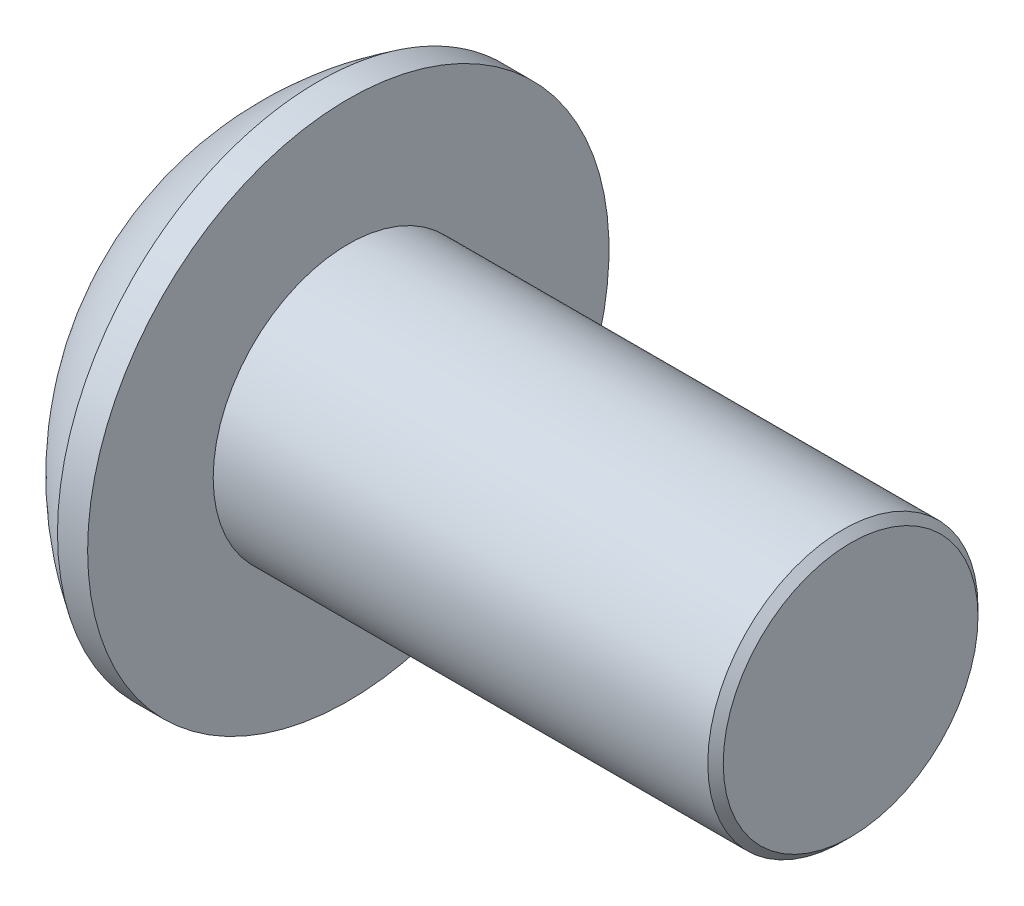
ISO-10303-21;
HEADER;
FILE_DESCRIPTION(('STEP AP214'),'2;1');
FILE_NAME('part.step','',(''),(''),'','','');
FILE_SCHEMA(('AUTOMOTIVE_DESIGN { 1 0 10303 214 1 1 1 1 }'));
ENDSEC;
DATA;
#1=APPLICATION_CONTEXT('core data for automotive mechanical design processes');
#2=APPLICATION_PROTOCOL_DEFINITION('international standard','automotive_design',2000,#1);
#3=PRODUCT_CONTEXT('',#1,'mechanical');
#4=PRODUCT('Part','Part','',(#3));
#5=PRODUCT_RELATED_PRODUCT_CATEGORY('part','',(#4));
#6=PRODUCT_DEFINITION_FORMATION('','',#4);
#7=PRODUCT_DEFINITION_CONTEXT('part definition',#1,'design');
#8=PRODUCT_DEFINITION('design','',#6,#7);
#9=PRODUCT_DEFINITION_SHAPE('','',#8);
#10=(LENGTH_UNIT() NAMED_UNIT(*) SI_UNIT(.MILLI.,.METRE.));
#11=(NAMED_UNIT(*) PLANE_ANGLE_UNIT() SI_UNIT($,.RADIAN.));
#12=(NAMED_UNIT(*) SI_UNIT($,.STERADIAN.) SOLID_ANGLE_UNIT());
#13=UNCERTAINTY_MEASURE_WITH_UNIT(LENGTH_MEASURE(1.E-05),#10,'distance_accuracy_value','');
#14=(GEOMETRIC_REPRESENTATION_CONTEXT(3) GLOBAL_UNCERTAINTY_ASSIGNED_CONTEXT((#13)) GLOBAL_UNIT_ASSIGNED_CONTEXT((#10,
#11,#12)) REPRESENTATION_CONTEXT('',''));
#15=CARTESIAN_POINT('',(0.,0.,0.));
#16=DIRECTION('',(0.,0.,1.));
#17=DIRECTION('',(1.,0.,0.));
#18=AXIS2_PLACEMENT_3D('',#15,#16,#17);
#19=CARTESIAN_POINT('',(1.32080000000034,0.,0.));
#20=DIRECTION('',(-1.,0.,0.));
#21=DIRECTION('',(0.,0.,1.));
#22=AXIS2_PLACEMENT_3D('',#19,#20,#21);
#23=CONICAL_SURFACE('',#22,1.1937999999998,1.04719755119608);
#24=CARTESIAN_POINT('',(2.01004075135902,0.,4.44089209850063E-13));
#25=VERTEX_POINT('',#24);
#26=VERTEX_LOOP('',#25);
#27=FACE_BOUND('',#26,.T.);
#28=CARTESIAN_POINT('',(1.32080000000009,0.,0.));
#29=DIRECTION('',(-1.,0.,0.));
#30=DIRECTION('',(0.,0.,1.));
#31=AXIS2_PLACEMENT_3D('',#28,#29,#30);
#32=CIRCLE('',#31,1.19380000000024);
#33=CARTESIAN_POINT('',(1.32080000000004,-1.03386112703797,0.59690000000006));
#34=VERTEX_POINT('',#33);
#35=CARTESIAN_POINT('',(1.32080000000004,0.,1.19380000000012));
#36=VERTEX_POINT('',#35);
#37=EDGE_CURVE('E20',#34,#36,#32,.T.);
#38=ORIENTED_EDGE('',*,*,#37,.T.);
#39=CARTESIAN_POINT('',(1.32080000000009,0.,0.));
#40=DIRECTION('',(-1.,0.,0.));
#41=DIRECTION('',(0.,0.,1.));
#42=AXIS2_PLACEMENT_3D('',#39,#40,#41);
#43=CIRCLE('',#42,1.19380000000024);
#44=CARTESIAN_POINT('',(1.32080000000004,1.03386112703797,0.596900000000061));
#45=VERTEX_POINT('',#44);
#46=EDGE_CURVE('E148',#36,#45,#43,.T.);
#47=ORIENTED_EDGE('',*,*,#46,.T.);
#48=CARTESIAN_POINT('',(1.32080000000009,0.,0.));
#49=DIRECTION('',(-1.,0.,0.));
#50=DIRECTION('',(0.,0.,1.));
#51=AXIS2_PLACEMENT_3D('',#48,#49,#50);
#52=CIRCLE('',#51,1.19380000000024);
#53=CARTESIAN_POINT('',(1.32080000000004,1.03386112703797,-0.596900000000061));
#54=VERTEX_POINT('',#53);
#55=EDGE_CURVE('E445',#45,#54,#52,.T.);
#56=ORIENTED_EDGE('',*,*,#55,.T.);
#57=CARTESIAN_POINT('',(1.32080000000009,0.,0.));
#58=DIRECTION('',(-1.,0.,0.));
#59=DIRECTION('',(0.,0.,1.));
#60=AXIS2_PLACEMENT_3D('',#57,#58,#59);
#61=CIRCLE('',#60,1.19380000000024);
#62=CARTESIAN_POINT('',(1.32080000000004,1.49457637585666E-12,-1.19380000000012));
#63=VERTEX_POINT('',#62);
#64=EDGE_CURVE('E446',#54,#63,#61,.T.);
#65=ORIENTED_EDGE('',*,*,#64,.T.);
#66=CARTESIAN_POINT('',(1.32080000000009,0.,0.));
#67=DIRECTION('',(-1.,0.,0.));
#68=DIRECTION('',(0.,0.,1.));
#69=AXIS2_PLACEMENT_3D('',#66,#67,#68);
#70=CIRCLE('',#69,1.19380000000024);
#71=CARTESIAN_POINT('',(1.32080000000004,-1.03386112703797,-0.596900000000061));
#72=VERTEX_POINT('',#71);
#73=EDGE_CURVE('E93',#63,#72,#70,.T.);
#74=ORIENTED_EDGE('',*,*,#73,.T.);
#75=CARTESIAN_POINT('',(1.32080000000009,0.,0.));
#76=DIRECTION('',(-1.,0.,0.));
#77=DIRECTION('',(0.,0.,1.));
#78=AXIS2_PLACEMENT_3D('',#75,#76,#77);
#79=CIRCLE('',#78,1.19380000000024);
#80=EDGE_CURVE('E89',#72,#34,#79,.T.);
#81=ORIENTED_EDGE('',*,*,#80,.T.);
#82=EDGE_LOOP('',(#38,#47,#56,#65,#74,#81));
#83=FACE_BOUND('',#82,.T.);
#84=ADVANCED_FACE('F17',(#27,#83),#23,.F.);
#85=CARTESIAN_POINT('',(1.3208,-2.06772225407573,-1.1938));
#86=DIRECTION('',(1.,0.,0.));
#87=DIRECTION('',(0.,0.,-1.));
#88=AXIS2_PLACEMENT_3D('',#85,#86,#87);
#89=PLANE('',#88);
#90=DIRECTION('',(0.,0.5,0.866025403784439));
#91=VECTOR('',#90,1.);
#92=CARTESIAN_POINT('',(1.3208,-1.37848150271715,0.));
#93=LINE('',#92,#91);
#94=CARTESIAN_POINT('',(1.3208,-0.689240751358575,1.1938));
#95=VERTEX_POINT('',#94);
#96=EDGE_CURVE('E101',#95,#34,#93,.F.);
#97=ORIENTED_EDGE('',*,*,#96,.F.);
#98=DIRECTION('',(0.,1.,0.));
#99=VECTOR('',#98,1.);
#100=CARTESIAN_POINT('',(1.3208,-0.689240751358575,1.1938));
#101=LINE('',#100,#99);
#102=EDGE_CURVE('E103',#36,#95,#101,.F.);
#103=ORIENTED_EDGE('',*,*,#102,.F.);
#104=ORIENTED_EDGE('',*,*,#37,.F.);
#105=EDGE_LOOP('',(#97,#103,#104));
#106=FACE_BOUND('',#105,.T.);
#107=ADVANCED_FACE('F99',(#106),#89,.F.);
#108=CARTESIAN_POINT('',(1.3208,-2.06772225407573,-1.1938));
#109=DIRECTION('',(1.,0.,0.));
#110=DIRECTION('',(0.,0.,-1.));
#111=AXIS2_PLACEMENT_3D('',#108,#109,#110);
#112=PLANE('',#111);
#113=DIRECTION('',(0.,-0.5,0.866025403784439));
#114=VECTOR('',#113,1.);
#115=CARTESIAN_POINT('',(1.3208,-0.689240751358575,-1.1938));
#116=LINE('',#115,#114);
#117=CARTESIAN_POINT('',(1.3208,-1.37848150271715,0.));
#118=VERTEX_POINT('',#117);
#119=EDGE_CURVE('E109',#118,#72,#116,.F.);
#120=ORIENTED_EDGE('',*,*,#119,.F.);
#121=DIRECTION('',(0.,0.5,0.866025403784439));
#122=VECTOR('',#121,1.);
#123=CARTESIAN_POINT('',(1.3208,-1.37848150271715,0.));
#124=LINE('',#123,#122);
#125=EDGE_CURVE('E106',#34,#118,#124,.F.);
#126=ORIENTED_EDGE('',*,*,#125,.F.);
#127=ORIENTED_EDGE('',*,*,#80,.F.);
#128=EDGE_LOOP('',(#120,#126,#127));
#129=FACE_BOUND('',#128,.T.);
#130=ADVANCED_FACE('F107',(#129),#112,.F.);
#131=CARTESIAN_POINT('',(1.3208,-2.06772225407573,-1.1938));
#132=DIRECTION('',(1.,0.,0.));
#133=DIRECTION('',(0.,0.,-1.));
#134=AXIS2_PLACEMENT_3D('',#131,#132,#133);
#135=PLANE('',#134);
#136=DIRECTION('',(0.,1.,0.));
#137=VECTOR('',#136,1.);
#138=CARTESIAN_POINT('',(1.3208,0.689240751358575,-1.1938));
#139=LINE('',#138,#137);
#140=CARTESIAN_POINT('',(1.3208,-0.689240751358575,-1.1938));
#141=VERTEX_POINT('',#140);
#142=EDGE_CURVE('E416',#141,#63,#139,.T.);
#143=ORIENTED_EDGE('',*,*,#142,.F.);
#144=DIRECTION('',(0.,-0.5,0.866025403784439));
#145=VECTOR('',#144,1.);
#146=CARTESIAN_POINT('',(1.3208,-0.689240751358575,-1.1938));
#147=LINE('',#146,#145);
#148=EDGE_CURVE('E428',#72,#141,#147,.F.);
#149=ORIENTED_EDGE('',*,*,#148,.F.);
#150=ORIENTED_EDGE('',*,*,#73,.F.);
#151=EDGE_LOOP('',(#143,#149,#150));
#152=FACE_BOUND('',#151,.T.);
#153=ADVANCED_FACE('F191',(#152),#135,.F.);
#154=CARTESIAN_POINT('',(1.3208,-2.06772225407573,-1.1938));
#155=DIRECTION('',(1.,0.,0.));
#156=DIRECTION('',(0.,0.,-1.));
#157=AXIS2_PLACEMENT_3D('',#154,#155,#156);
#158=PLANE('',#157);
#159=DIRECTION('',(0.,-0.5,-0.866025403784439));
#160=VECTOR('',#159,1.);
#161=CARTESIAN_POINT('',(1.3208,1.37848150271715,0.));
#162=LINE('',#161,#160);
#163=CARTESIAN_POINT('',(1.3208,0.689240751358575,-1.1938));
#164=VERTEX_POINT('',#163);
#165=EDGE_CURVE('E402',#164,#54,#162,.F.);
#166=ORIENTED_EDGE('',*,*,#165,.F.);
#167=DIRECTION('',(0.,1.,0.));
#168=VECTOR('',#167,1.);
#169=CARTESIAN_POINT('',(1.3208,0.689240751358575,-1.1938));
#170=LINE('',#169,#168);
#171=EDGE_CURVE('E413',#63,#164,#170,.T.);
#172=ORIENTED_EDGE('',*,*,#171,.F.);
#173=ORIENTED_EDGE('',*,*,#64,.F.);
#174=EDGE_LOOP('',(#166,#172,#173));
#175=FACE_BOUND('',#174,.T.);
#176=ADVANCED_FACE('F187',(#175),#158,.F.);
#177=CARTESIAN_POINT('',(1.3208,-2.06772225407573,-1.1938));
#178=DIRECTION('',(1.,0.,0.));
#179=DIRECTION('',(0.,0.,-1.));
#180=AXIS2_PLACEMENT_3D('',#177,#178,#179);
#181=PLANE('',#180);
#182=DIRECTION('',(0.,0.5,-0.866025403784439));
#183=VECTOR('',#182,1.);
#184=CARTESIAN_POINT('',(1.3208,0.689240751358575,1.1938));
#185=LINE('',#184,#183);
#186=CARTESIAN_POINT('',(1.3208,1.37848150271715,0.));
#187=VERTEX_POINT('',#186);
#188=EDGE_CURVE('E381',#187,#45,#185,.F.);
#189=ORIENTED_EDGE('',*,*,#188,.F.);
#190=DIRECTION('',(0.,-0.5,-0.866025403784439));
#191=VECTOR('',#190,1.);
#192=CARTESIAN_POINT('',(1.3208,1.37848150271715,0.));
#193=LINE('',#192,#191);
#194=EDGE_CURVE('E400',#54,#187,#193,.F.);
#195=ORIENTED_EDGE('',*,*,#194,.F.);
#196=ORIENTED_EDGE('',*,*,#55,.F.);
#197=EDGE_LOOP('',(#189,#195,#196));
#198=FACE_BOUND('',#197,.T.);
#199=ADVANCED_FACE('F183',(#198),#181,.F.);
#200=CARTESIAN_POINT('',(1.3208,-2.06772225407573,-1.1938));
#201=DIRECTION('',(1.,0.,0.));
#202=DIRECTION('',(0.,0.,-1.));
#203=AXIS2_PLACEMENT_3D('',#200,#201,#202);
#204=PLANE('',#203);
#205=DIRECTION('',(0.,1.,0.));
#206=VECTOR('',#205,1.);
#207=CARTESIAN_POINT('',(1.3208,-0.689240751358575,1.1938));
#208=LINE('',#207,#206);
#209=CARTESIAN_POINT('',(1.3208,0.689240751358575,1.1938));
#210=VERTEX_POINT('',#209);
#211=EDGE_CURVE('E118',#210,#36,#208,.F.);
#212=ORIENTED_EDGE('',*,*,#211,.F.);
#213=DIRECTION('',(0.,0.5,-0.866025403784439));
#214=VECTOR('',#213,1.);
#215=CARTESIAN_POINT('',(1.3208,0.689240751358575,1.1938));
#216=LINE('',#215,#214);
#217=EDGE_CURVE('E384',#45,#210,#216,.F.);
#218=ORIENTED_EDGE('',*,*,#217,.F.);
#219=ORIENTED_EDGE('',*,*,#46,.F.);
#220=EDGE_LOOP('',(#212,#218,#219));
#221=FACE_BOUND('',#220,.T.);
#222=ADVANCED_FACE('F179',(#221),#204,.F.);
#223=CARTESIAN_POINT('',(1.3208,-0.689240751358575,1.1938));
#224=DIRECTION('',(0.,0.,-1.));
#225=DIRECTION('',(0.,1.,0.));
#226=AXIS2_PLACEMENT_3D('',#223,#224,#225);
#227=PLANE('',#226);
#228=DIRECTION('',(0.,1.,0.));
#229=VECTOR('',#228,1.);
#230=CARTESIAN_POINT('',(0.,0.,1.1938));
#231=LINE('',#230,#229);
#232=CARTESIAN_POINT('',(0.,0.689240751358575,1.1938));
#233=VERTEX_POINT('',#232);
#234=CARTESIAN_POINT('',(0.,-0.689240751358575,1.1938));
#235=VERTEX_POINT('',#234);
#236=EDGE_CURVE('E378',#233,#235,#231,.F.);
#237=ORIENTED_EDGE('',*,*,#236,.F.);
#238=DIRECTION('',(1.,0.,0.));
#239=VECTOR('',#238,1.);
#240=CARTESIAN_POINT('',(1.3208,0.689240751358575,1.1938));
#241=LINE('',#240,#239);
#242=EDGE_CURVE('E390',#210,#233,#241,.F.);
#243=ORIENTED_EDGE('',*,*,#242,.F.);
#244=ORIENTED_EDGE('',*,*,#211,.T.);
#245=ORIENTED_EDGE('',*,*,#102,.T.);
#246=DIRECTION('',(1.,0.,0.));
#247=VECTOR('',#246,1.);
#248=CARTESIAN_POINT('',(1.3208,-0.689240751358575,1.1938));
#249=LINE('',#248,#247);
#250=EDGE_CURVE('E112',#235,#95,#249,.T.);
#251=ORIENTED_EDGE('',*,*,#250,.F.);
#252=EDGE_LOOP('',(#237,#243,#244,#245,#251));
#253=FACE_BOUND('',#252,.T.);
#254=ADVANCED_FACE('F176',(#253),#227,.T.);
#255=CARTESIAN_POINT('',(1.3208,-1.37848150271715,0.));
#256=DIRECTION('',(0.,0.866025403784439,-0.5));
#257=DIRECTION('',(0.,0.5,0.866025403784439));
#258=AXIS2_PLACEMENT_3D('',#255,#256,#257);
#259=PLANE('',#258);
#260=DIRECTION('',(0.,-0.5,-0.866025403784439));
#261=VECTOR('',#260,1.);
#262=CARTESIAN_POINT('',(0.,-0.689240751358575,1.1938));
#263=LINE('',#262,#261);
#264=CARTESIAN_POINT('',(0.,-1.37848150271715,0.));
#265=VERTEX_POINT('',#264);
#266=EDGE_CURVE('E375',#235,#265,#263,.T.);
#267=ORIENTED_EDGE('',*,*,#266,.F.);
#268=ORIENTED_EDGE('',*,*,#250,.T.);
#269=ORIENTED_EDGE('',*,*,#96,.T.);
#270=ORIENTED_EDGE('',*,*,#125,.T.);
#271=DIRECTION('',(1.,0.,0.));
#272=VECTOR('',#271,1.);
#273=CARTESIAN_POINT('',(1.3208,-1.37848150271715,0.));
#274=LINE('',#273,#272);
#275=EDGE_CURVE('E425',#265,#118,#274,.T.);
#276=ORIENTED_EDGE('',*,*,#275,.F.);
#277=EDGE_LOOP('',(#267,#268,#269,#270,#276));
#278=FACE_BOUND('',#277,.T.);
#279=ADVANCED_FACE('F116',(#278),#259,.T.);
#280=CARTESIAN_POINT('',(1.3208,-0.689240751358575,-1.1938));
#281=DIRECTION('',(0.,0.866025403784439,0.5));
#282=DIRECTION('',(0.,-0.5,0.866025403784439));
#283=AXIS2_PLACEMENT_3D('',#280,#281,#282);
#284=PLANE('',#283);
#285=DIRECTION('',(0.,0.5,-0.866025403784439));
#286=VECTOR('',#285,1.);
#287=CARTESIAN_POINT('',(0.,-1.37848150271715,0.));
#288=LINE('',#287,#286);
#289=CARTESIAN_POINT('',(0.,-0.689240751358575,-1.1938));
#290=VERTEX_POINT('',#289);
#291=EDGE_CURVE('E372',#265,#290,#288,.T.);
#292=ORIENTED_EDGE('',*,*,#291,.F.);
#293=ORIENTED_EDGE('',*,*,#275,.T.);
#294=ORIENTED_EDGE('',*,*,#119,.T.);
#295=ORIENTED_EDGE('',*,*,#148,.T.);
#296=DIRECTION('',(1.,0.,0.));
#297=VECTOR('',#296,1.);
#298=CARTESIAN_POINT('',(1.3208,-0.689240751358575,-1.1938));
#299=LINE('',#298,#297);
#300=EDGE_CURVE('E410',#290,#141,#299,.T.);
#301=ORIENTED_EDGE('',*,*,#300,.F.);
#302=EDGE_LOOP('',(#292,#293,#294,#295,#301));
#303=FACE_BOUND('',#302,.T.);
#304=ADVANCED_FACE('F169',(#303),#284,.T.);
#305=CARTESIAN_POINT('',(1.3208,0.689240751358575,-1.1938));
#306=DIRECTION('',(0.,0.,1.));
#307=DIRECTION('',(1.,0.,0.));
#308=AXIS2_PLACEMENT_3D('',#305,#306,#307);
#309=PLANE('',#308);
#310=DIRECTION('',(0.,1.,0.));
#311=VECTOR('',#310,1.);
#312=CARTESIAN_POINT('',(0.,0.,-1.1938));
#313=LINE('',#312,#311);
#314=CARTESIAN_POINT('',(0.,0.689240751358575,-1.1938));
#315=VERTEX_POINT('',#314);
#316=EDGE_CURVE('E369',#290,#315,#313,.T.);
#317=ORIENTED_EDGE('',*,*,#316,.F.);
#318=ORIENTED_EDGE('',*,*,#300,.T.);
#319=ORIENTED_EDGE('',*,*,#142,.T.);
#320=ORIENTED_EDGE('',*,*,#171,.T.);
#321=DIRECTION('',(1.,0.,0.));
#322=VECTOR('',#321,1.);
#323=CARTESIAN_POINT('',(1.3208,0.689240751358575,-1.1938));
#324=LINE('',#323,#322);
#325=EDGE_CURVE('E385',#315,#164,#324,.T.);
#326=ORIENTED_EDGE('',*,*,#325,.F.);
#327=EDGE_LOOP('',(#317,#318,#319,#320,#326));
#328=FACE_BOUND('',#327,.T.);
#329=ADVANCED_FACE('F166',(#328),#309,.T.);
#330=CARTESIAN_POINT('',(1.3208,1.37848150271715,0.));
#331=DIRECTION('',(0.,-0.866025403784439,0.5));
#332=DIRECTION('',(0.,-0.5,-0.866025403784439));
#333=AXIS2_PLACEMENT_3D('',#330,#331,#332);
#334=PLANE('',#333);
#335=DIRECTION('',(0.,0.5,0.866025403784439));
#336=VECTOR('',#335,1.);
#337=CARTESIAN_POINT('',(0.,0.689240751358575,-1.1938));
#338=LINE('',#337,#336);
#339=CARTESIAN_POINT('',(0.,1.37848150271715,0.));
#340=VERTEX_POINT('',#339);
#341=EDGE_CURVE('E366',#315,#340,#338,.T.);
#342=ORIENTED_EDGE('',*,*,#341,.F.);
#343=ORIENTED_EDGE('',*,*,#325,.T.);
#344=ORIENTED_EDGE('',*,*,#165,.T.);
#345=ORIENTED_EDGE('',*,*,#194,.T.);
#346=DIRECTION('',(1.,0.,0.));
#347=VECTOR('',#346,1.);
#348=CARTESIAN_POINT('',(1.3208,1.37848150271715,0.));
#349=LINE('',#348,#347);
#350=EDGE_CURVE('E35',#340,#187,#349,.T.);
#351=ORIENTED_EDGE('',*,*,#350,.F.);
#352=EDGE_LOOP('',(#342,#343,#344,#345,#351));
#353=FACE_BOUND('',#352,.T.);
#354=ADVANCED_FACE('F162',(#353),#334,.T.);
#355=CARTESIAN_POINT('',(1.3208,0.689240751358575,1.1938));
#356=DIRECTION('',(0.,-0.866025403784439,-0.5));
#357=DIRECTION('',(0.,0.5,-0.866025403784439));
#358=AXIS2_PLACEMENT_3D('',#355,#356,#357);
#359=PLANE('',#358);
#360=DIRECTION('',(0.,-0.5,0.866025403784439));
#361=VECTOR('',#360,1.);
#362=CARTESIAN_POINT('',(0.,1.37848150271715,0.));
#363=LINE('',#362,#361);
#364=EDGE_CURVE('E147',#340,#233,#363,.T.);
#365=ORIENTED_EDGE('',*,*,#364,.F.);
#366=ORIENTED_EDGE('',*,*,#350,.T.);
#367=ORIENTED_EDGE('',*,*,#188,.T.);
#368=ORIENTED_EDGE('',*,*,#217,.T.);
#369=ORIENTED_EDGE('',*,*,#242,.T.);
#370=EDGE_LOOP('',(#365,#366,#367,#368,#369));
#371=FACE_BOUND('',#370,.T.);
#372=ADVANCED_FACE('F158',(#371),#359,.T.);
#373=CARTESIAN_POINT('',(0.,0.,0.));
#374=DIRECTION('',(-1.,0.,0.));
#375=DIRECTION('',(0.,0.,1.));
#376=AXIS2_PLACEMENT_3D('',#373,#374,#375);
#377=PLANE('',#376);
#378=ORIENTED_EDGE('',*,*,#341,.T.);
#379=ORIENTED_EDGE('',*,*,#364,.T.);
#380=ORIENTED_EDGE('',*,*,#236,.T.);
#381=ORIENTED_EDGE('',*,*,#266,.T.);
#382=ORIENTED_EDGE('',*,*,#291,.T.);
#383=ORIENTED_EDGE('',*,*,#316,.T.);
#384=EDGE_LOOP('',(#378,#379,#380,#381,#382,#383));
#385=FACE_BOUND('',#384,.T.);
#386=CARTESIAN_POINT('',(0.,1.647825,0.));
#387=CARTESIAN_POINT('',(1.63519156892115E-13,1.64781976319874,0.0924902039777532));
#388=CARTESIAN_POINT('',(1.3280260282674E-13,1.63999511633709,0.18514501432637));
#389=CARTESIAN_POINT('',(0.,1.6167119250047,0.322075808080014));
#390=CARTESIAN_POINT('',(-1.58318794569898E-13,1.60700618770234,0.367435533396361));
#391=CARTESIAN_POINT('',(1.5888139631505E-13,1.58380101865853,0.457220935695141));
#392=CARTESIAN_POINT('',(5.68557833423821E-13,1.57029850831031,0.501645823115264));
#393=CARTESIAN_POINT('',(9.3616121179063E-13,1.52428156574313,0.632817459278968));
#394=CARTESIAN_POINT('',(0.,1.48621992666366,0.717681965518643));
#395=CARTESIAN_POINT('',(0.,1.39637079695658,0.879809706624016));
#396=CARTESIAN_POINT('',(7.82242536497637E-13,1.34458278455109,0.957072652379996));
#397=CARTESIAN_POINT('',(4.86953568155855E-13,1.25777784714522,1.06558770210238));
#398=CARTESIAN_POINT('',(1.33447060642817E-13,1.22729946114794,1.10054993332365));
#399=CARTESIAN_POINT('',(-1.32884925775019E-13,1.16354004969107,1.16775237388221));
#400=CARTESIAN_POINT('',(0.,1.13026175473033,1.19999517515816));
#401=CARTESIAN_POINT('',(0.,1.02649304340867,1.29236218866442));
#402=CARTESIAN_POINT('',(0.,0.952049986714079,1.34814848277713));
#403=CARTESIAN_POINT('',(0.,0.794895196754069,1.44639825105766));
#404=CARTESIAN_POINT('',(0.,0.712183775431297,1.48886222758992));
#405=CARTESIAN_POINT('',(0.,0.54079662426573,1.55930919813143));
#406=CARTESIAN_POINT('',(0.,0.452120958135286,1.58729234680269));
#407=CARTESIAN_POINT('',(0.,0.271332331080317,1.62797191307414));
#408=CARTESIAN_POINT('',(0.,0.179219351801789,1.64066824903626));
#409=CARTESIAN_POINT('',(0.,-0.00583077027840882,1.65041748705409));
#410=CARTESIAN_POINT('',(0.,-0.0987679130800783,1.64747038910979));
#411=CARTESIAN_POINT('',(0.,-0.282830196388826,1.62601274134436));
#412=CARTESIAN_POINT('',(0.,-0.37395534657002,1.60750227463794));
#413=CARTESIAN_POINT('',(0.,-0.551796068178806,1.55545413364524));
#414=CARTESIAN_POINT('',(0.,-0.638511592498167,1.52191629885844));
#415=CARTESIAN_POINT('',(0.,-0.805120175533155,1.44072378052347));
#416=CARTESIAN_POINT('',(0.,-0.885012976819958,1.39306856461393));
#417=CARTESIAN_POINT('',(0.,-0.997912879588362,1.31211658756413));
#418=CARTESIAN_POINT('',(0.,-1.0343949246834,1.28354906167735));
#419=CARTESIAN_POINT('',(0.,-1.10486279842069,1.2234182930371));
#420=CARTESIAN_POINT('',(0.,-1.13884618403291,1.19185218578118));
#421=CARTESIAN_POINT('',(0.,-1.23657300939909,1.09305906467359));
#422=CARTESIAN_POINT('',(0.,-1.29619288399357,1.02166556658613));
#423=CARTESIAN_POINT('',(0.,-1.40258050817756,0.869876423478036));
#424=CARTESIAN_POINT('',(0.,-1.44934874627767,0.789481120793481));
#425=CARTESIAN_POINT('',(0.,-1.50889406070376,0.663870959313344));
#426=CARTESIAN_POINT('',(0.,-1.52698985473587,0.621110806760431));
#427=CARTESIAN_POINT('',(0.,-1.55950093966665,0.534260776864334));
#428=CARTESIAN_POINT('',(-1.04973140146496E-13,-1.57391920916438,0.490172008203172));
#429=CARTESIAN_POINT('',(2.10045254706393E-13,-1.6114617790958,0.356445777718599));
#430=CARTESIAN_POINT('',(1.14250083706093E-12,-1.62897899568075,0.265126085962908));
#431=CARTESIAN_POINT('',(4.34054466733687E-13,-1.64174347214909,0.144386595969389));
#432=CARTESIAN_POINT('',(1.21340306256601E-13,-1.64402207668917,0.115560405797875));
#433=CARTESIAN_POINT('',(-1.20906625387681E-13,-1.64706365940121,0.0578281757252701));
#434=CARTESIAN_POINT('',(0.,-1.64782663757319,0.0289221358241782));
#435=CARTESIAN_POINT('',(1.64941431812562E-13,-1.64781976319875,-0.0924902039777541));
#436=CARTESIAN_POINT('',(1.33069267383729E-13,-1.6399951163371,-0.185145014326371));
#437=CARTESIAN_POINT('',(0.,-1.61671192500471,-0.322075808080015));
#438=CARTESIAN_POINT('',(-1.58362753759592E-13,-1.60700618770235,-0.367435533396362));
#439=CARTESIAN_POINT('',(1.58925391252273E-13,-1.58380101865854,-0.457220935695142));
#440=CARTESIAN_POINT('',(5.68599984465805E-13,-1.57029850831032,-0.501645823115265));
#441=CARTESIAN_POINT('',(9.360771106357E-13,-1.52428156574314,-0.632817459278968));
#442=CARTESIAN_POINT('',(0.,-1.48621992666367,-0.717681965518644));
#443=CARTESIAN_POINT('',(0.,-1.39637079695659,-0.879809706624018));
#444=CARTESIAN_POINT('',(7.83473156940465E-13,-1.3445827845511,-0.957072652379998));
#445=CARTESIAN_POINT('',(4.87639062539118E-13,-1.25777784714523,-1.06558770210238));
#446=CARTESIAN_POINT('',(1.33633557334351E-13,-1.22729946114795,-1.10054993332365));
#447=CARTESIAN_POINT('',(-1.33071242655653E-13,-1.16354004969107,-1.16775237388221));
#448=CARTESIAN_POINT('',(0.,-1.13026175473034,-1.19999517515816));
#449=CARTESIAN_POINT('',(0.,-1.02649304340868,-1.29236218866442));
#450=CARTESIAN_POINT('',(0.,-0.95204998671409,-1.34814848277713));
#451=CARTESIAN_POINT('',(0.,-0.79489519675408,-1.44639825105766));
#452=CARTESIAN_POINT('',(0.,-0.712183775431308,-1.48886222758992));
#453=CARTESIAN_POINT('',(0.,-0.540796624265741,-1.55930919813143));
#454=CARTESIAN_POINT('',(0.,-0.452120958135297,-1.58729234680269));
#455=CARTESIAN_POINT('',(0.,-0.271332331080327,-1.62797191307414));
#456=CARTESIAN_POINT('',(0.,-0.179219351801799,-1.64066824903626));
#457=CARTESIAN_POINT('',(0.,0.00583077027839878,-1.65041748705409));
#458=CARTESIAN_POINT('',(0.,0.0987679130800683,-1.64747038910979));
#459=CARTESIAN_POINT('',(0.,0.282830196388816,-1.62601274134436));
#460=CARTESIAN_POINT('',(0.,0.37395534657001,-1.60750227463795));
#461=CARTESIAN_POINT('',(0.,0.551796068178796,-1.55545413364524));
#462=CARTESIAN_POINT('',(0.,0.638511592498158,-1.52191629885844));
#463=CARTESIAN_POINT('',(0.,0.805120175533146,-1.44072378052347));
#464=CARTESIAN_POINT('',(0.,0.885012976819948,-1.39306856461394));
#465=CARTESIAN_POINT('',(0.,0.997912879588351,-1.31211658756413));
#466=CARTESIAN_POINT('',(0.,1.03439492468339,-1.28354906167735));
#467=CARTESIAN_POINT('',(0.,1.10486279842068,-1.2234182930371));
#468=CARTESIAN_POINT('',(0.,1.1388461840329,-1.19185218578118));
#469=CARTESIAN_POINT('',(0.,1.23657300939908,-1.09305906467359));
#470=CARTESIAN_POINT('',(0.,1.29619288399356,-1.02166556658613));
#471=CARTESIAN_POINT('',(0.,1.40258050817755,-0.869876423478035));
#472=CARTESIAN_POINT('',(0.,1.44934874627766,-0.789481120793481));
#473=CARTESIAN_POINT('',(0.,1.50889406070375,-0.663870959313343));
#474=CARTESIAN_POINT('',(0.,1.52698985473586,-0.62111080676043));
#475=CARTESIAN_POINT('',(0.,1.55950093966664,-0.534260776864333));
#476=CARTESIAN_POINT('',(-1.0525400134382E-13,1.57391920916438,-0.49017200820317));
#477=CARTESIAN_POINT('',(2.10605504450137E-13,1.61146177909579,-0.356445777718598));
#478=CARTESIAN_POINT('',(1.14555106174587E-12,1.62897899568074,-0.265126085962907));
#479=CARTESIAN_POINT('',(4.3537782659486E-13,1.64174347214909,-0.144386595969388));
#480=CARTESIAN_POINT('',(1.21880186581217E-13,1.64402207668916,-0.115560405797875));
#481=CARTESIAN_POINT('',(-1.21446505712297E-13,1.6470636594012,-0.0578281757252703));
#482=CARTESIAN_POINT('',(0.,1.64782663757318,-0.0289221358241787));
#483=CARTESIAN_POINT('',(0.,1.647825,0.));
#484=B_SPLINE_CURVE_WITH_KNOTS('',3,(#386,#387,#388,#389,#390,#391,#392,#393,#394,#395,#396,
#397,#398,#399,#400,#401,#402,#403,#404,#405,#406,#407,#408,#409,#410,#411,#412,#413,#414,#415,
#416,#417,#418,#419,#420,#421,#422,#423,#424,#425,#426,#427,#428,#429,#430,#431,#432,#433,#434,
#435,#436,#437,#438,#439,#440,#441,#442,#443,#444,#445,#446,#447,#448,#449,#450,#451,#452,#453,
#454,#455,#456,#457,#458,#459,#460,#461,#462,#463,#464,#465,#466,#467,#468,#469,#470,#471,#472,
#473,#474,#475,#476,#477,#478,#479,#480,#481,#482,#483),.UNSPECIFIED.,.T.,.F.,(4,2,2,2,2,2,2,2,
2,2,2,2,2,2,2,2,2,2,2,2,2,2,2,2,2,2,2,2,2,2,2,2,2,2,2,2,2,2,2,2,2,2,2,2,2,2,2,2,4),(0.,
0.277336029422427,0.416368541537112,0.555514114625601,0.833141970294988,1.11078038089036,
1.24978149120748,1.38864858351854,1.66629367015056,1.94392828594775,2.22155993641642,
2.49919306954938,2.77682620268235,3.05445785315102,3.33209246894821,3.60973755557991,
3.74860464789075,3.88760575820768,4.16524416880333,4.44287202447289,4.58201759756162,
4.72105010967663,4.99838613909884,5.08511046196678,5.17183478483478,5.44917081425721,
5.58820332637189,5.72734889946038,6.00497675512977,6.28261516572515,6.42161627604226,
6.56048336835333,6.83812845498534,7.11576307078253,7.39339472125121,7.67102785438416,
7.94866098751713,8.2262926379858,8.50392725378299,8.78157234041469,8.92043943272553,
9.05944054304246,9.33707895363812,9.61470680930767,9.7538523823964,9.89288489451142,
10.1702209239336,10.2569452468016,10.3436695696696),.UNSPECIFIED.);
#485=CARTESIAN_POINT('',(0.,1.647825,0.));
#486=VERTEX_POINT('',#485);
#487=EDGE_CURVE('E140',#486,#486,#484,.T.);
#488=ORIENTED_EDGE('',*,*,#487,.F.);
#489=EDGE_LOOP('',(#488));
#490=FACE_BOUND('',#489,.T.);
#491=ADVANCED_FACE('F154',(#385,#490),#377,.T.);
#492=CARTESIAN_POINT('',(3.50132362607759,0.,0.));
#493=DIRECTION('',(0.,1.,0.));
#494=DIRECTION('',(1.,0.,0.));
#495=AXIS2_PLACEMENT_3D('',#492,#493,#494);
#496=SPHERICAL_SURFACE('',#495,3.86970210289554);
#497=CARTESIAN_POINT('',(1.4732,0.,0.));
#498=DIRECTION('',(-1.,0.,0.));
#499=DIRECTION('',(0.,0.,1.));
#500=AXIS2_PLACEMENT_3D('',#497,#498,#499);
#501=CIRCLE('',#500,3.29565);
#502=CARTESIAN_POINT('',(1.4732,0.,3.29565));
#503=VERTEX_POINT('',#502);
#504=EDGE_CURVE('E137',#503,#503,#501,.F.);
#505=ORIENTED_EDGE('',*,*,#504,.F.);
#506=EDGE_LOOP('',(#505));
#507=FACE_BOUND('',#506,.T.);
#508=ORIENTED_EDGE('',*,*,#487,.T.);
#509=EDGE_LOOP('',(#508));
#510=FACE_BOUND('',#509,.T.);
#511=ADVANCED_FACE('F150',(#507,#510),#496,.T.);
#512=CARTESIAN_POINT('',(8.2042,0.,0.));
#513=DIRECTION('',(-1.,0.,0.));
#514=DIRECTION('',(0.,0.,1.));
#515=AXIS2_PLACEMENT_3D('',#512,#513,#514);
#516=PLANE('',#515);
#517=CARTESIAN_POINT('',(8.20420000002287,0.,0.));
#518=DIRECTION('',(-1.,0.,0.));
#519=DIRECTION('',(0.,0.,1.));
#520=AXIS2_PLACEMENT_3D('',#517,#518,#519);
#521=CIRCLE('',#520,1.61036000002923);
#522=CARTESIAN_POINT('',(8.20420000002287,0.,1.61036000002923));
#523=VERTEX_POINT('',#522);
#524=EDGE_CURVE('E134',#523,#523,#521,.T.);
#525=ORIENTED_EDGE('',*,*,#524,.F.);
#526=EDGE_LOOP('',(#525));
#527=FACE_BOUND('',#526,.T.);
#528=ADVANCED_FACE('F221',(#527),#516,.F.);
#529=CARTESIAN_POINT('',(0.,0.,0.));
#530=DIRECTION('',(-1.,0.,0.));
#531=DIRECTION('',(0.,0.,1.));
#532=AXIS2_PLACEMENT_3D('',#529,#530,#531);
#533=CYLINDRICAL_SURFACE('',#532,3.29565);
#534=ORIENTED_EDGE('',*,*,#504,.T.);
#535=EDGE_LOOP('',(#534));
#536=FACE_BOUND('',#535,.T.);
#537=CARTESIAN_POINT('',(1.8542,0.,0.));
#538=DIRECTION('',(-1.,0.,0.));
#539=DIRECTION('',(0.,0.,1.));
#540=AXIS2_PLACEMENT_3D('',#537,#538,#539);
#541=CIRCLE('',#540,3.29565);
#542=CARTESIAN_POINT('',(1.8542,0.,3.29565));
#543=VERTEX_POINT('',#542);
#544=EDGE_CURVE('E131',#543,#543,#541,.T.);
#545=ORIENTED_EDGE('',*,*,#544,.T.);
#546=EDGE_LOOP('',(#545));
#547=FACE_BOUND('',#546,.T.);
#548=ADVANCED_FACE('F218',(#536,#547),#533,.T.);
#549=CARTESIAN_POINT('',(8.10641000003898,0.,0.));
#550=DIRECTION('',(-1.,0.,0.));
#551=DIRECTION('',(0.,0.,1.));
#552=AXIS2_PLACEMENT_3D('',#549,#550,#551);
#553=CONICAL_SURFACE('',#552,1.70814999995628,0.785398163106808);
#554=CARTESIAN_POINT('',(8.10641000000005,0.,0.));
#555=DIRECTION('',(-1.,0.,0.));
#556=DIRECTION('',(0.,0.,1.));
#557=AXIS2_PLACEMENT_3D('',#554,#555,#556);
#558=CIRCLE('',#557,1.70814999999999);
#559=CARTESIAN_POINT('',(8.10641000000005,0.,1.70814999999999));
#560=VERTEX_POINT('',#559);
#561=EDGE_CURVE('E26',#560,#560,#558,.T.);
#562=ORIENTED_EDGE('',*,*,#561,.F.);
#563=EDGE_LOOP('',(#562));
#564=FACE_BOUND('',#563,.T.);
#565=ORIENTED_EDGE('',*,*,#524,.T.);
#566=EDGE_LOOP('',(#565));
#567=FACE_BOUND('',#566,.T.);
#568=ADVANCED_FACE('F211',(#564,#567),#553,.T.);
#569=CARTESIAN_POINT('',(1.8542,1.70814999999999,0.));
#570=DIRECTION('',(-1.,0.,0.));
#571=DIRECTION('',(0.,0.,1.));
#572=AXIS2_PLACEMENT_3D('',#569,#570,#571);
#573=PLANE('',#572);
#574=CARTESIAN_POINT('',(1.8542,0.,0.));
#575=DIRECTION('',(-1.,0.,0.));
#576=DIRECTION('',(0.,0.,1.));
#577=AXIS2_PLACEMENT_3D('',#574,#575,#576);
#578=CIRCLE('',#577,1.70814999999999);
#579=CARTESIAN_POINT('',(1.8542,0.,1.70814999999999));
#580=VERTEX_POINT('',#579);
#581=EDGE_CURVE('E11',#580,#580,#578,.F.);
#582=ORIENTED_EDGE('',*,*,#581,.F.);
#583=EDGE_LOOP('',(#582));
#584=FACE_BOUND('',#583,.T.);
#585=ORIENTED_EDGE('',*,*,#544,.F.);
#586=EDGE_LOOP('',(#585));
#587=FACE_BOUND('',#586,.T.);
#588=ADVANCED_FACE('F205',(#584,#587),#573,.F.);
#589=CARTESIAN_POINT('',(0.,0.,0.));
#590=DIRECTION('',(-1.,0.,0.));
#591=DIRECTION('',(0.,0.,1.));
#592=AXIS2_PLACEMENT_3D('',#589,#590,#591);
#593=CYLINDRICAL_SURFACE('',#592,1.70814999999999);
#594=ORIENTED_EDGE('',*,*,#581,.T.);
#595=EDGE_LOOP('',(#594));
#596=FACE_BOUND('',#595,.T.);
#597=ORIENTED_EDGE('',*,*,#561,.T.);
#598=EDGE_LOOP('',(#597));
#599=FACE_BOUND('',#598,.T.);
#600=ADVANCED_FACE('F203',(#596,#599),#593,.T.);
#601=CLOSED_SHELL('',(#84,#107,#130,#153,#176,#199,#222,#254,#279,#304,#329,#354,#372,#491,#511,
#528,#548,#568,#588,#600));
#602=MANIFOLD_SOLID_BREP('B1',#601);
#603=ADVANCED_BREP_SHAPE_REPRESENTATION('',(#18,#602),#14);
#604=SHAPE_DEFINITION_REPRESENTATION(#9,#603);
ENDSEC;
END-ISO-10303-21;
